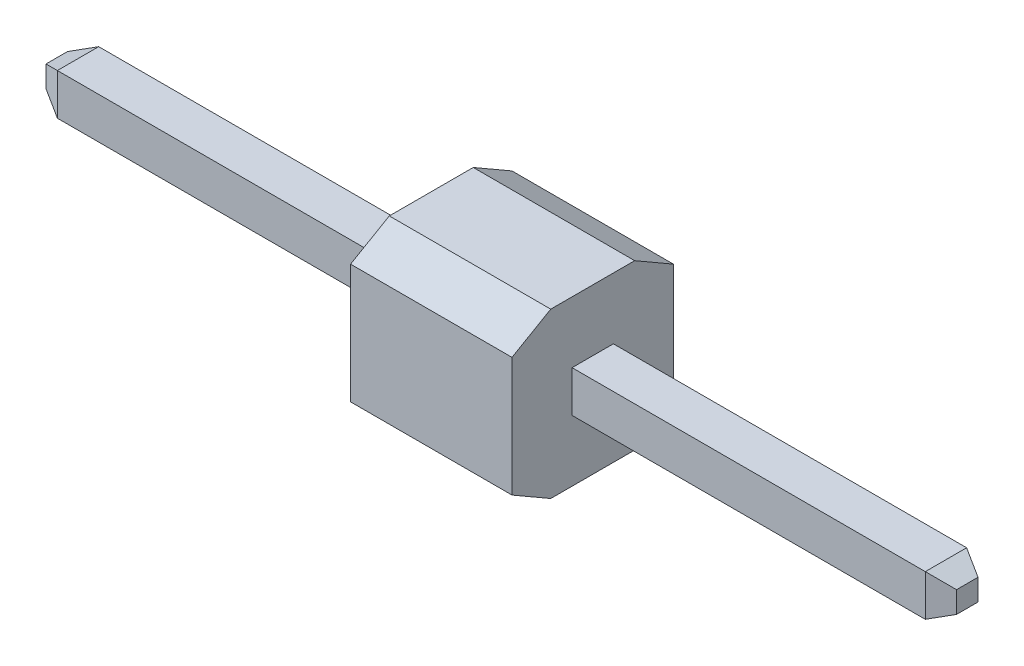
ISO-10303-21;
HEADER;
FILE_DESCRIPTION(('STEP AP214'),'2;1');
FILE_NAME('part.step','',(''),(''),'','','');
FILE_SCHEMA(('AUTOMOTIVE_DESIGN { 1 0 10303 214 1 1 1 1 }'));
ENDSEC;
DATA;
#1=APPLICATION_CONTEXT('core data for automotive mechanical design processes');
#2=APPLICATION_PROTOCOL_DEFINITION('international standard','automotive_design',2000,#1);
#3=PRODUCT_CONTEXT('',#1,'mechanical');
#4=PRODUCT('Part','Part','',(#3));
#5=PRODUCT_RELATED_PRODUCT_CATEGORY('part','',(#4));
#6=PRODUCT_DEFINITION_FORMATION('','',#4);
#7=PRODUCT_DEFINITION_CONTEXT('part definition',#1,'design');
#8=PRODUCT_DEFINITION('design','',#6,#7);
#9=PRODUCT_DEFINITION_SHAPE('','',#8);
#10=(LENGTH_UNIT() NAMED_UNIT(*) SI_UNIT(.MILLI.,.METRE.));
#11=(NAMED_UNIT(*) PLANE_ANGLE_UNIT() SI_UNIT($,.RADIAN.));
#12=(NAMED_UNIT(*) SI_UNIT($,.STERADIAN.) SOLID_ANGLE_UNIT());
#13=UNCERTAINTY_MEASURE_WITH_UNIT(LENGTH_MEASURE(1.E-05),#10,'distance_accuracy_value','');
#14=(GEOMETRIC_REPRESENTATION_CONTEXT(3) GLOBAL_UNCERTAINTY_ASSIGNED_CONTEXT((#13)) GLOBAL_UNIT_ASSIGNED_CONTEXT((#10,
#11,#12)) REPRESENTATION_CONTEXT('',''));
#15=CARTESIAN_POINT('',(0.,0.,0.));
#16=DIRECTION('',(0.,0.,1.));
#17=DIRECTION('',(1.,0.,0.));
#18=AXIS2_PLACEMENT_3D('',#15,#16,#17);
#19=CARTESIAN_POINT('',(5.42107505657293,-2.8571215871937,0.629998634255617));
#20=DIRECTION('',(1.,4.37113882867379E-08,-4.37113882867379E-08));
#21=DIRECTION('',(-4.37113882867379E-08,1.,0.));
#22=AXIS2_PLACEMENT_3D('',#19,#20,#21);
#23=PLANE('',#22);
#24=DIRECTION('',(1.59994777304463E-08,0.500000000000193,0.866025403784327));
#25=VECTOR('',#24,1.);
#26=CARTESIAN_POINT('',(5.42107493358702,-1.6135317487037,-0.940001365744382));
#27=LINE('',#26,#25);
#28=CARTESIAN_POINT('',(5.42107493358702,-1.6135317487037,-0.940001365744382));
#29=VERTEX_POINT('',#28);
#30=CARTESIAN_POINT('',(5.42107494467178,-1.2671215871937,-0.340001365744383));
#31=VERTEX_POINT('',#30);
#32=EDGE_CURVE('E11',#29,#31,#27,.T.);
#33=ORIENTED_EDGE('',*,*,#32,.T.);
#34=DIRECTION('',(4.37113886966664E-08,0.,0.999999999999999));
#35=VECTOR('',#34,1.);
#36=CARTESIAN_POINT('',(5.42107494467178,-1.2671215871937,-0.340001365744383));
#37=LINE('',#36,#35);
#38=CARTESIAN_POINT('',(5.42107500149658,-1.2671215871937,0.959998634255618));
#39=VERTEX_POINT('',#38);
#40=EDGE_CURVE('E304',#31,#39,#37,.T.);
#41=ORIENTED_EDGE('',*,*,#40,.T.);
#42=DIRECTION('',(5.97108668825761E-08,-0.500000000000188,0.866025403784328));
#43=VECTOR('',#42,1.);
#44=CARTESIAN_POINT('',(5.42107500149658,-1.2671215871937,0.959998634255618));
#45=LINE('',#44,#43);
#46=CARTESIAN_POINT('',(5.42107504286549,-1.61353174870369,1.55999863425562));
#47=VERTEX_POINT('',#46);
#48=EDGE_CURVE('E296',#39,#47,#45,.T.);
#49=ORIENTED_EDGE('',*,*,#48,.T.);
#50=DIRECTION('',(4.37113884815545E-08,-0.999999999999999,0.));
#51=VECTOR('',#50,1.);
#52=CARTESIAN_POINT('',(5.42107504286549,-1.61353174870369,1.55999863425562));
#53=LINE('',#52,#51);
#54=CARTESIAN_POINT('',(5.42107512360828,-3.4607114256737,1.55999863425562));
#55=VERTEX_POINT('',#54);
#56=EDGE_CURVE('E281',#47,#55,#53,.T.);
#57=ORIENTED_EDGE('',*,*,#56,.T.);
#58=DIRECTION('',(1.5999479012306E-08,0.500000000000193,0.866025403784327));
#59=VECTOR('',#58,1.);
#60=CARTESIAN_POINT('',(5.42107511252351,-3.8071215871937,0.959998634255618));
#61=LINE('',#60,#59);
#62=CARTESIAN_POINT('',(5.42107511252351,-3.8071215871937,0.959998634255618));
#63=VERTEX_POINT('',#62);
#64=EDGE_CURVE('E265',#63,#55,#61,.T.);
#65=ORIENTED_EDGE('',*,*,#64,.F.);
#66=DIRECTION('',(4.37113886966664E-08,0.,0.999999999999999));
#67=VECTOR('',#66,1.);
#68=CARTESIAN_POINT('',(5.42107505569871,-3.8071215871937,-0.340001365744383));
#69=LINE('',#68,#67);
#70=CARTESIAN_POINT('',(5.42107505569871,-3.8071215871937,-0.340001365744383));
#71=VERTEX_POINT('',#70);
#72=EDGE_CURVE('E248',#71,#63,#69,.T.);
#73=ORIENTED_EDGE('',*,*,#72,.F.);
#74=DIRECTION('',(5.97108656001698E-08,-0.50000000000019,0.866025403784327));
#75=VECTOR('',#74,1.);
#76=CARTESIAN_POINT('',(5.4210750143298,-3.4607114256737,-0.940001365744382));
#77=LINE('',#76,#75);
#78=CARTESIAN_POINT('',(5.4210750143298,-3.4607114256737,-0.940001365744382));
#79=VERTEX_POINT('',#78);
#80=EDGE_CURVE('E242',#79,#71,#77,.T.);
#81=ORIENTED_EDGE('',*,*,#80,.F.);
#82=DIRECTION('',(4.37113884815545E-08,-0.999999999999999,0.));
#83=VECTOR('',#82,1.);
#84=CARTESIAN_POINT('',(5.42107493358702,-1.6135317487037,-0.940001365744382));
#85=LINE('',#84,#83);
#86=EDGE_CURVE('E236',#29,#79,#85,.T.);
#87=ORIENTED_EDGE('',*,*,#86,.F.);
#88=EDGE_LOOP('',(#33,#41,#49,#57,#65,#73,#81,#87));
#89=FACE_BOUND('',#88,.T.);
#90=DIRECTION('',(-4.37113886753159E-08,0.,-0.999999999999999));
#91=VECTOR('',#90,1.);
#92=CARTESIAN_POINT('',(5.42107502859765,-2.2171215871937,0.629998634255617));
#93=LINE('',#92,#91);
#94=CARTESIAN_POINT('',(5.42107502859765,-2.2171215871937,0.629998634255617));
#95=VERTEX_POINT('',#94);
#96=CARTESIAN_POINT('',(5.42107500062236,-2.2171215871937,-0.0100013657443826));
#97=VERTEX_POINT('',#96);
#98=EDGE_CURVE('E302',#95,#97,#93,.T.);
#99=ORIENTED_EDGE('',*,*,#98,.T.);
#100=DIRECTION('',(-4.3711388675316E-08,0.999999999999999,0.));
#101=VECTOR('',#100,1.);
#102=CARTESIAN_POINT('',(5.42107502859765,-2.8571215871937,-0.0100013657443826));
#103=LINE('',#102,#101);
#104=CARTESIAN_POINT('',(5.42107502859765,-2.8571215871937,-0.0100013657443826));
#105=VERTEX_POINT('',#104);
#106=EDGE_CURVE('E293',#105,#97,#103,.T.);
#107=ORIENTED_EDGE('',*,*,#106,.F.);
#108=DIRECTION('',(-4.37113886753159E-08,0.,-0.999999999999999));
#109=VECTOR('',#108,1.);
#110=CARTESIAN_POINT('',(5.42107505657293,-2.8571215871937,0.629998634255617));
#111=LINE('',#110,#109);
#112=CARTESIAN_POINT('',(5.42107505657293,-2.8571215871937,0.629998634255617));
#113=VERTEX_POINT('',#112);
#114=EDGE_CURVE('E278',#113,#105,#111,.T.);
#115=ORIENTED_EDGE('',*,*,#114,.F.);
#116=DIRECTION('',(-4.3711388675316E-08,0.999999999999999,0.));
#117=VECTOR('',#116,1.);
#118=CARTESIAN_POINT('',(5.42107505657293,-2.8571215871937,0.629998634255617));
#119=LINE('',#118,#117);
#120=EDGE_CURVE('E263',#113,#95,#119,.T.);
#121=ORIENTED_EDGE('',*,*,#120,.T.);
#122=EDGE_LOOP('',(#99,#107,#115,#121));
#123=FACE_BOUND('',#122,.T.);
#124=ADVANCED_FACE('F17',(#89,#123),#23,.T.);
#125=CARTESIAN_POINT('',(2.92107505657293,-2.85712169647217,0.629998743534088));
#126=DIRECTION('',(1.,4.37113882867379E-08,-4.37113882867379E-08));
#127=DIRECTION('',(-4.37113882867379E-08,1.,0.));
#128=AXIS2_PLACEMENT_3D('',#125,#126,#127);
#129=PLANE('',#128);
#130=DIRECTION('',(1.59994783714339E-08,0.500000000000193,0.866025403784327));
#131=VECTOR('',#130,1.);
#132=CARTESIAN_POINT('',(2.92107493358702,-1.61353185798217,-0.940001256465912));
#133=LINE('',#132,#131);
#134=CARTESIAN_POINT('',(2.92107493358702,-1.61353185798217,-0.940001256465912));
#135=VERTEX_POINT('',#134);
#136=CARTESIAN_POINT('',(2.92107494467178,-1.26712169647217,-0.340001256465912));
#137=VERTEX_POINT('',#136);
#138=EDGE_CURVE('E24',#135,#137,#133,.T.);
#139=ORIENTED_EDGE('',*,*,#138,.F.);
#140=DIRECTION('',(4.37113882411397E-08,-0.999999999999999,0.));
#141=VECTOR('',#140,1.);
#142=CARTESIAN_POINT('',(2.92107493358702,-1.61353185798217,-0.940001256465912));
#143=LINE('',#142,#141);
#144=CARTESIAN_POINT('',(2.9210750143298,-3.46071153495217,-0.940001256465912));
#145=VERTEX_POINT('',#144);
#146=EDGE_CURVE('E300',#135,#145,#143,.T.);
#147=ORIENTED_EDGE('',*,*,#146,.T.);
#148=DIRECTION('',(5.97108668821449E-08,-0.50000000000019,0.866025403784327));
#149=VECTOR('',#148,1.);
#150=CARTESIAN_POINT('',(2.9210750143298,-3.46071153495217,-0.940001256465912));
#151=LINE('',#150,#149);
#152=CARTESIAN_POINT('',(2.92107505569871,-3.80712169647217,-0.340001256465912));
#153=VERTEX_POINT('',#152);
#154=EDGE_CURVE('E286',#145,#153,#151,.T.);
#155=ORIENTED_EDGE('',*,*,#154,.T.);
#156=DIRECTION('',(4.37113883550593E-08,0.,0.999999999999999));
#157=VECTOR('',#156,1.);
#158=CARTESIAN_POINT('',(2.92107505569871,-3.80712169647217,-0.340001256465912));
#159=LINE('',#158,#157);
#160=CARTESIAN_POINT('',(2.92107511252351,-3.80712169647217,0.959998743534088));
#161=VERTEX_POINT('',#160);
#162=EDGE_CURVE('E271',#153,#161,#159,.T.);
#163=ORIENTED_EDGE('',*,*,#162,.T.);
#164=DIRECTION('',(1.59994783713184E-08,0.500000000000193,0.866025403784327));
#165=VECTOR('',#164,1.);
#166=CARTESIAN_POINT('',(2.92107511252351,-3.80712169647217,0.959998743534088));
#167=LINE('',#166,#165);
#168=CARTESIAN_POINT('',(2.92107512360828,-3.46071153495217,1.55999874353409));
#169=VERTEX_POINT('',#168);
#170=EDGE_CURVE('E253',#161,#169,#167,.T.);
#171=ORIENTED_EDGE('',*,*,#170,.T.);
#172=DIRECTION('',(4.37113882411397E-08,-0.999999999999999,0.));
#173=VECTOR('',#172,1.);
#174=CARTESIAN_POINT('',(2.92107504286549,-1.61353185798217,1.55999874353409));
#175=LINE('',#174,#173);
#176=CARTESIAN_POINT('',(2.92107504286549,-1.61353185798217,1.55999874353409));
#177=VERTEX_POINT('',#176);
#178=EDGE_CURVE('E261',#177,#169,#175,.T.);
#179=ORIENTED_EDGE('',*,*,#178,.F.);
#180=DIRECTION('',(5.97108668825761E-08,-0.500000000000188,0.866025403784328));
#181=VECTOR('',#180,1.);
#182=CARTESIAN_POINT('',(2.92107500149659,-1.26712169647217,0.959998743534088));
#183=LINE('',#182,#181);
#184=CARTESIAN_POINT('',(2.92107500149659,-1.26712169647217,0.959998743534088));
#185=VERTEX_POINT('',#184);
#186=EDGE_CURVE('E276',#185,#177,#183,.T.);
#187=ORIENTED_EDGE('',*,*,#186,.F.);
#188=DIRECTION('',(4.37113883550593E-08,0.,0.999999999999999));
#189=VECTOR('',#188,1.);
#190=CARTESIAN_POINT('',(2.92107494467178,-1.26712169647217,-0.340001256465912));
#191=LINE('',#190,#189);
#192=EDGE_CURVE('E291',#137,#185,#191,.T.);
#193=ORIENTED_EDGE('',*,*,#192,.F.);
#194=EDGE_LOOP('',(#139,#147,#155,#163,#171,#179,#187,#193));
#195=FACE_BOUND('',#194,.T.);
#196=DIRECTION('',(-4.3711388675316E-08,0.999999999999999,0.));
#197=VECTOR('',#196,1.);
#198=CARTESIAN_POINT('',(2.92107502859765,-2.85712169647217,-0.0100012564659119));
#199=LINE('',#198,#197);
#200=CARTESIAN_POINT('',(2.92107502859765,-2.85712169647217,-0.0100012564659119));
#201=VERTEX_POINT('',#200);
#202=CARTESIAN_POINT('',(2.92107500062236,-2.21712169647217,-0.0100012564659119));
#203=VERTEX_POINT('',#202);
#204=EDGE_CURVE('E298',#201,#203,#199,.T.);
#205=ORIENTED_EDGE('',*,*,#204,.T.);
#206=DIRECTION('',(-4.37113886753159E-08,0.,-0.999999999999999));
#207=VECTOR('',#206,1.);
#208=CARTESIAN_POINT('',(2.92107502859765,-2.21712169647217,0.629998743534088));
#209=LINE('',#208,#207);
#210=CARTESIAN_POINT('',(2.92107502859765,-2.21712169647217,0.629998743534088));
#211=VERTEX_POINT('',#210);
#212=EDGE_CURVE('E283',#211,#203,#209,.T.);
#213=ORIENTED_EDGE('',*,*,#212,.F.);
#214=DIRECTION('',(-4.37113879814266E-08,0.999999999999999,0.));
#215=VECTOR('',#214,1.);
#216=CARTESIAN_POINT('',(2.92107505657293,-2.85712169647217,0.629998743534088));
#217=LINE('',#216,#215);
#218=CARTESIAN_POINT('',(2.92107505657293,-2.85712169647217,0.629998743534088));
#219=VERTEX_POINT('',#218);
#220=EDGE_CURVE('E268',#219,#211,#217,.T.);
#221=ORIENTED_EDGE('',*,*,#220,.F.);
#222=DIRECTION('',(-4.37113879814266E-08,0.,-0.999999999999999));
#223=VECTOR('',#222,1.);
#224=CARTESIAN_POINT('',(2.92107505657293,-2.85712169647217,0.629998743534088));
#225=LINE('',#224,#223);
#226=EDGE_CURVE('E251',#219,#201,#225,.T.);
#227=ORIENTED_EDGE('',*,*,#226,.T.);
#228=EDGE_LOOP('',(#205,#213,#221,#227));
#229=FACE_BOUND('',#228,.T.);
#230=ADVANCED_FACE('F314',(#195,#229),#129,.F.);
#231=CARTESIAN_POINT('',(5.42107493358702,-1.6135317487037,-0.940001365744382));
#232=DIRECTION('',(5.97108668343731E-08,-0.866025403784328,0.50000000000019));
#233=DIRECTION('',(-1.59994785476185E-08,-0.500000000000192,-0.866025403784329));
#234=AXIS2_PLACEMENT_3D('',#231,#232,#233);
#235=PLANE('',#234);
#236=ORIENTED_EDGE('',*,*,#138,.T.);
#237=DIRECTION('',(-0.999999999999998,-4.37113875761951E-08,4.37113883755557E-08));
#238=VECTOR('',#237,1.);
#239=CARTESIAN_POINT('',(5.42107494467178,-1.2671215871937,-0.340001365744383));
#240=LINE('',#239,#238);
#241=EDGE_CURVE('E288',#31,#137,#240,.T.);
#242=ORIENTED_EDGE('',*,*,#241,.F.);
#243=ORIENTED_EDGE('',*,*,#32,.F.);
#244=DIRECTION('',(-0.999999999999998,-4.37113882867378E-08,4.37113881091022E-08));
#245=VECTOR('',#244,1.);
#246=CARTESIAN_POINT('',(5.42107493358702,-1.6135317487037,-0.940001365744382));
#247=LINE('',#246,#245);
#248=EDGE_CURVE('E256',#29,#135,#247,.T.);
#249=ORIENTED_EDGE('',*,*,#248,.T.);
#250=EDGE_LOOP('',(#236,#242,#243,#249));
#251=FACE_BOUND('',#250,.T.);
#252=ADVANCED_FACE('F306',(#251),#235,.F.);
#253=CARTESIAN_POINT('',(5.42107494467178,-1.2671215871937,-0.340001365744383));
#254=DIRECTION('',(4.37113882867379E-08,-1.,0.));
#255=DIRECTION('',(1.,4.37113882867379E-08,-4.37113882867379E-08));
#256=AXIS2_PLACEMENT_3D('',#253,#254,#255);
#257=PLANE('',#256);
#258=ORIENTED_EDGE('',*,*,#192,.T.);
#259=DIRECTION('',(-0.999999999999998,-4.37113875761951E-08,4.37113882867378E-08));
#260=VECTOR('',#259,1.);
#261=CARTESIAN_POINT('',(5.42107500149658,-1.2671215871937,0.959998634255618));
#262=LINE('',#261,#260);
#263=EDGE_CURVE('E273',#39,#185,#262,.T.);
#264=ORIENTED_EDGE('',*,*,#263,.F.);
#265=ORIENTED_EDGE('',*,*,#40,.F.);
#266=ORIENTED_EDGE('',*,*,#241,.T.);
#267=EDGE_LOOP('',(#258,#264,#265,#266));
#268=FACE_BOUND('',#267,.T.);
#269=ADVANCED_FACE('F311',(#268),#257,.F.);
#270=CARTESIAN_POINT('',(5.42107500149658,-1.2671215871937,0.959998634255618));
#271=DIRECTION('',(1.59994785476185E-08,-0.86602540378433,-0.50000000000019));
#272=DIRECTION('',(-5.97108668343731E-08,0.500000000000188,-0.866025403784329));
#273=AXIS2_PLACEMENT_3D('',#270,#271,#272);
#274=PLANE('',#273);
#275=ORIENTED_EDGE('',*,*,#186,.T.);
#276=DIRECTION('',(-0.999999999999998,-4.37113882867378E-08,4.37113882867378E-08));
#277=VECTOR('',#276,1.);
#278=CARTESIAN_POINT('',(5.42107504286549,-1.61353174870369,1.55999863425562));
#279=LINE('',#278,#277);
#280=EDGE_CURVE('E258',#47,#177,#279,.T.);
#281=ORIENTED_EDGE('',*,*,#280,.F.);
#282=ORIENTED_EDGE('',*,*,#48,.F.);
#283=ORIENTED_EDGE('',*,*,#263,.T.);
#284=EDGE_LOOP('',(#275,#281,#282,#283));
#285=FACE_BOUND('',#284,.T.);
#286=ADVANCED_FACE('F319',(#285),#274,.F.);
#287=CARTESIAN_POINT('',(5.42107504286549,-1.61353174870369,1.55999863425562));
#288=DIRECTION('',(-4.37113882867379E-08,0.,-1.));
#289=DIRECTION('',(-1.,-4.37113882867379E-08,4.37113882867379E-08));
#290=AXIS2_PLACEMENT_3D('',#287,#288,#289);
#291=PLANE('',#290);
#292=ORIENTED_EDGE('',*,*,#178,.T.);
#293=DIRECTION('',(-0.999999999999998,-4.37113882867378E-08,4.37113882867378E-08));
#294=VECTOR('',#293,1.);
#295=CARTESIAN_POINT('',(5.42107512360828,-3.4607114256737,1.55999863425562));
#296=LINE('',#295,#294);
#297=EDGE_CURVE('E245',#55,#169,#296,.T.);
#298=ORIENTED_EDGE('',*,*,#297,.F.);
#299=ORIENTED_EDGE('',*,*,#56,.F.);
#300=ORIENTED_EDGE('',*,*,#280,.T.);
#301=EDGE_LOOP('',(#292,#298,#299,#300));
#302=FACE_BOUND('',#301,.T.);
#303=ADVANCED_FACE('F326',(#302),#291,.F.);
#304=CARTESIAN_POINT('',(5.42107511252351,-3.8071215871937,0.959998634255618));
#305=DIRECTION('',(5.97108668343731E-08,-0.866025403784328,0.50000000000019));
#306=DIRECTION('',(-1.59994785476185E-08,-0.500000000000192,-0.866025403784329));
#307=AXIS2_PLACEMENT_3D('',#304,#305,#306);
#308=PLANE('',#307);
#309=ORIENTED_EDGE('',*,*,#170,.F.);
#310=DIRECTION('',(-0.999999999999998,-4.37113868656524E-08,4.37113882867378E-08));
#311=VECTOR('',#310,1.);
#312=CARTESIAN_POINT('',(5.42107511252351,-3.8071215871937,0.959998634255618));
#313=LINE('',#312,#311);
#314=EDGE_CURVE('E239',#63,#161,#313,.T.);
#315=ORIENTED_EDGE('',*,*,#314,.F.);
#316=ORIENTED_EDGE('',*,*,#64,.T.);
#317=ORIENTED_EDGE('',*,*,#297,.T.);
#318=EDGE_LOOP('',(#309,#315,#316,#317));
#319=FACE_BOUND('',#318,.T.);
#320=ADVANCED_FACE('F329',(#319),#308,.T.);
#321=CARTESIAN_POINT('',(5.42107505569871,-3.8071215871937,-0.340001365744383));
#322=DIRECTION('',(4.37113882867379E-08,-1.,0.));
#323=DIRECTION('',(1.,4.37113882867379E-08,-4.37113882867379E-08));
#324=AXIS2_PLACEMENT_3D('',#321,#322,#323);
#325=PLANE('',#324);
#326=ORIENTED_EDGE('',*,*,#162,.F.);
#327=DIRECTION('',(-0.999999999999998,-4.37113868656524E-08,4.37113883755557E-08));
#328=VECTOR('',#327,1.);
#329=CARTESIAN_POINT('',(5.42107505569871,-3.8071215871937,-0.340001365744383));
#330=LINE('',#329,#328);
#331=EDGE_CURVE('E233',#71,#153,#330,.T.);
#332=ORIENTED_EDGE('',*,*,#331,.F.);
#333=ORIENTED_EDGE('',*,*,#72,.T.);
#334=ORIENTED_EDGE('',*,*,#314,.T.);
#335=EDGE_LOOP('',(#326,#332,#333,#334));
#336=FACE_BOUND('',#335,.T.);
#337=ADVANCED_FACE('F333',(#336),#325,.T.);
#338=CARTESIAN_POINT('',(5.4210750143298,-3.4607114256737,-0.940001365744382));
#339=DIRECTION('',(1.59994785476185E-08,-0.86602540378433,-0.50000000000019));
#340=DIRECTION('',(-5.97108668343731E-08,0.500000000000188,-0.866025403784329));
#341=AXIS2_PLACEMENT_3D('',#338,#339,#340);
#342=PLANE('',#341);
#343=ORIENTED_EDGE('',*,*,#154,.F.);
#344=DIRECTION('',(-0.999999999999998,-4.37113882867378E-08,4.37113881091021E-08));
#345=VECTOR('',#344,1.);
#346=CARTESIAN_POINT('',(5.4210750143298,-3.4607114256737,-0.940001365744382));
#347=LINE('',#346,#345);
#348=EDGE_CURVE('E230',#79,#145,#347,.T.);
#349=ORIENTED_EDGE('',*,*,#348,.F.);
#350=ORIENTED_EDGE('',*,*,#80,.T.);
#351=ORIENTED_EDGE('',*,*,#331,.T.);
#352=EDGE_LOOP('',(#343,#349,#350,#351));
#353=FACE_BOUND('',#352,.T.);
#354=ADVANCED_FACE('F337',(#353),#342,.T.);
#355=CARTESIAN_POINT('',(5.42107493358702,-1.6135317487037,-0.940001365744382));
#356=DIRECTION('',(-4.37113882867379E-08,0.,-1.));
#357=DIRECTION('',(-4.37113882867379E-08,1.,0.));
#358=AXIS2_PLACEMENT_3D('',#355,#356,#357);
#359=PLANE('',#358);
#360=ORIENTED_EDGE('',*,*,#146,.F.);
#361=ORIENTED_EDGE('',*,*,#248,.F.);
#362=ORIENTED_EDGE('',*,*,#86,.T.);
#363=ORIENTED_EDGE('',*,*,#348,.T.);
#364=EDGE_LOOP('',(#360,#361,#362,#363));
#365=FACE_BOUND('',#364,.T.);
#366=ADVANCED_FACE('F339',(#365),#359,.T.);
#367=CARTESIAN_POINT('',(-2.87892494342706,-2.85712194999822,0.62999899706014));
#368=DIRECTION('',(-1.,-4.37113882867379E-08,4.37113882867379E-08));
#369=DIRECTION('',(4.37113882867379E-08,-1.,0.));
#370=AXIS2_PLACEMENT_3D('',#367,#368,#369);
#371=PLANE('',#370);
#372=DIRECTION('',(4.3711387402424E-08,-0.999999999999999,0.));
#373=VECTOR('',#372,1.);
#374=CARTESIAN_POINT('',(-2.87892498592489,-2.37100347718822,0.14388052425114));
#375=LINE('',#374,#373);
#376=CARTESIAN_POINT('',(-2.87892498592489,-2.37100347718822,0.14388052425114));
#377=VERTEX_POINT('',#376);
#378=CARTESIAN_POINT('',(-2.87892497140235,-2.70324042279822,0.14388052425114));
#379=VERTEX_POINT('',#378);
#380=EDGE_CURVE('E228',#377,#379,#375,.T.);
#381=ORIENTED_EDGE('',*,*,#380,.T.);
#382=DIRECTION('',(4.37113874013716E-08,0.,0.999999999999999));
#383=VECTOR('',#382,1.);
#384=CARTESIAN_POINT('',(-2.87892497140235,-2.70324042279822,0.14388052425114));
#385=LINE('',#384,#383);
#386=CARTESIAN_POINT('',(-2.87892495687982,-2.70324042279822,0.47611746986914));
#387=VERTEX_POINT('',#386);
#388=EDGE_CURVE('E223',#379,#387,#385,.T.);
#389=ORIENTED_EDGE('',*,*,#388,.T.);
#390=DIRECTION('',(-4.37113900757526E-08,0.999999999999999,0.));
#391=VECTOR('',#390,1.);
#392=CARTESIAN_POINT('',(-2.87892495687982,-2.70324042279822,0.47611746986914));
#393=LINE('',#392,#391);
#394=CARTESIAN_POINT('',(-2.87892497140235,-2.37100347718822,0.47611746986914));
#395=VERTEX_POINT('',#394);
#396=EDGE_CURVE('E215',#387,#395,#393,.T.);
#397=ORIENTED_EDGE('',*,*,#396,.T.);
#398=DIRECTION('',(-4.37113847280434E-08,0.,-0.999999999999999));
#399=VECTOR('',#398,1.);
#400=CARTESIAN_POINT('',(-2.87892497140235,-2.37100347718822,0.47611746986914));
#401=LINE('',#400,#399);
#402=EDGE_CURVE('E207',#395,#377,#401,.T.);
#403=ORIENTED_EDGE('',*,*,#402,.T.);
#404=EDGE_LOOP('',(#381,#389,#397,#403));
#405=FACE_BOUND('',#404,.T.);
#406=ADVANCED_FACE('F341',(#405),#371,.T.);
#407=CARTESIAN_POINT('',(-2.87892494342706,-2.85712194999822,0.62999899706014));
#408=DIRECTION('',(4.37113882867379E-08,-1.,0.));
#409=DIRECTION('',(-4.37113882867379E-08,0.,-1.));
#410=AXIS2_PLACEMENT_3D('',#407,#408,#409);
#411=PLANE('',#410);
#412=DIRECTION('',(0.999999999999998,4.37113891700451E-08,-4.37113882769955E-08));
#413=VECTOR('',#412,1.);
#414=CARTESIAN_POINT('',(-2.54892494342706,-2.85712193557346,0.629998982635382));
#415=LINE('',#414,#413);
#416=CARTESIAN_POINT('',(-2.54892494342706,-2.85712193557346,0.629998982635382));
#417=VERTEX_POINT('',#416);
#418=EDGE_CURVE('E225',#417,#219,#415,.T.);
#419=ORIENTED_EDGE('',*,*,#418,.F.);
#420=DIRECTION('',(-4.37113886753159E-08,0.,-0.999999999999999));
#421=VECTOR('',#420,1.);
#422=CARTESIAN_POINT('',(-2.54892494342706,-2.85712193557346,0.629998982635382));
#423=LINE('',#422,#421);
#424=CARTESIAN_POINT('',(-2.54892497140235,-2.85712193557346,-0.010001017364618));
#425=VERTEX_POINT('',#424);
#426=EDGE_CURVE('E217',#417,#425,#423,.T.);
#427=ORIENTED_EDGE('',*,*,#426,.T.);
#428=DIRECTION('',(0.999999999999998,4.37113891700451E-08,-4.37113882161057E-08));
#429=VECTOR('',#428,1.);
#430=CARTESIAN_POINT('',(-2.54892497140235,-2.85712193557346,-0.010001017364618));
#431=LINE('',#430,#429);
#432=EDGE_CURVE('E220',#425,#201,#431,.T.);
#433=ORIENTED_EDGE('',*,*,#432,.T.);
#434=ORIENTED_EDGE('',*,*,#226,.F.);
#435=EDGE_LOOP('',(#419,#427,#433,#434));
#436=FACE_BOUND('',#435,.T.);
#437=ADVANCED_FACE('F348',(#436),#411,.T.);
#438=CARTESIAN_POINT('',(-2.87892497140235,-2.85712194999822,-0.0100010029398598));
#439=DIRECTION('',(-4.37113882867379E-08,0.,-1.));
#440=DIRECTION('',(-1.,-4.37113882867379E-08,4.37113882867379E-08));
#441=AXIS2_PLACEMENT_3D('',#438,#439,#440);
#442=PLANE('',#441);
#443=ORIENTED_EDGE('',*,*,#432,.F.);
#444=DIRECTION('',(-4.3711388675316E-08,0.999999999999999,0.));
#445=VECTOR('',#444,1.);
#446=CARTESIAN_POINT('',(-2.54892497140235,-2.85712193557346,-0.010001017364618));
#447=LINE('',#446,#445);
#448=CARTESIAN_POINT('',(-2.54892499937764,-2.21712193557346,-0.010001017364618));
#449=VERTEX_POINT('',#448);
#450=EDGE_CURVE('E209',#425,#449,#447,.T.);
#451=ORIENTED_EDGE('',*,*,#450,.T.);
#452=DIRECTION('',(0.999999999999998,4.37113888452998E-08,-4.37113882161057E-08));
#453=VECTOR('',#452,1.);
#454=CARTESIAN_POINT('',(-2.54892499937764,-2.21712193557346,-0.010001017364618));
#455=LINE('',#454,#453);
#456=EDGE_CURVE('E212',#449,#203,#455,.T.);
#457=ORIENTED_EDGE('',*,*,#456,.T.);
#458=ORIENTED_EDGE('',*,*,#204,.F.);
#459=EDGE_LOOP('',(#443,#451,#457,#458));
#460=FACE_BOUND('',#459,.T.);
#461=ADVANCED_FACE('F424',(#460),#442,.T.);
#462=CARTESIAN_POINT('',(-2.87892497140235,-2.21712194999822,0.62999899706014));
#463=DIRECTION('',(4.37113882867379E-08,-1.,0.));
#464=DIRECTION('',(-4.37113882867379E-08,0.,-1.));
#465=AXIS2_PLACEMENT_3D('',#462,#463,#464);
#466=PLANE('',#465);
#467=ORIENTED_EDGE('',*,*,#456,.F.);
#468=DIRECTION('',(4.37113900630947E-08,0.,0.999999999999999));
#469=VECTOR('',#468,1.);
#470=CARTESIAN_POINT('',(-2.54892499937764,-2.21712193557347,-0.010001017364618));
#471=LINE('',#470,#469);
#472=CARTESIAN_POINT('',(-2.54892497140235,-2.21712193557346,0.629998982635382));
#473=VERTEX_POINT('',#472);
#474=EDGE_CURVE('E201',#449,#473,#471,.T.);
#475=ORIENTED_EDGE('',*,*,#474,.T.);
#476=DIRECTION('',(0.999999999999998,4.37113888452998E-08,-4.37113882769955E-08));
#477=VECTOR('',#476,1.);
#478=CARTESIAN_POINT('',(-2.54892497140235,-2.21712193557346,0.629998982635382));
#479=LINE('',#478,#477);
#480=EDGE_CURVE('E204',#473,#211,#479,.T.);
#481=ORIENTED_EDGE('',*,*,#480,.T.);
#482=ORIENTED_EDGE('',*,*,#212,.T.);
#483=EDGE_LOOP('',(#467,#475,#481,#482));
#484=FACE_BOUND('',#483,.T.);
#485=ADVANCED_FACE('F421',(#484),#466,.F.);
#486=CARTESIAN_POINT('',(-2.87892494342706,-2.85712194999822,0.62999899706014));
#487=DIRECTION('',(-4.37113882867379E-08,0.,-1.));
#488=DIRECTION('',(-1.,-4.37113882867379E-08,4.37113882867379E-08));
#489=AXIS2_PLACEMENT_3D('',#486,#487,#488);
#490=PLANE('',#489);
#491=ORIENTED_EDGE('',*,*,#480,.F.);
#492=DIRECTION('',(4.37113900630948E-08,-0.999999999999999,0.));
#493=VECTOR('',#492,1.);
#494=CARTESIAN_POINT('',(-2.54892497140235,-2.21712193557346,0.629998982635382));
#495=LINE('',#494,#493);
#496=EDGE_CURVE('E196',#473,#417,#495,.T.);
#497=ORIENTED_EDGE('',*,*,#496,.T.);
#498=ORIENTED_EDGE('',*,*,#418,.T.);
#499=ORIENTED_EDGE('',*,*,#220,.T.);
#500=EDGE_LOOP('',(#491,#497,#498,#499));
#501=FACE_BOUND('',#500,.T.);
#502=ADVANCED_FACE('F376',(#501),#490,.F.);
#503=CARTESIAN_POINT('',(-2.87892494342706,-2.85712194999822,0.62999899706014));
#504=DIRECTION('',(-4.37113882867379E-08,0.,-1.));
#505=DIRECTION('',(-1.,-4.37113882867379E-08,4.37113882867379E-08));
#506=AXIS2_PLACEMENT_3D('',#503,#504,#505);
#507=PLANE('',#506);
#508=DIRECTION('',(0.999999999999998,4.37113933917341E-08,-4.37113882769955E-08));
#509=VECTOR('',#508,1.);
#510=CARTESIAN_POINT('',(5.42107505657293,-2.85712158719371,0.629998634255617));
#511=LINE('',#510,#509);
#512=CARTESIAN_POINT('',(10.8910750565729,-2.8571213480924,0.629998395154324));
#513=VERTEX_POINT('',#512);
#514=EDGE_CURVE('E199',#113,#513,#511,.T.);
#515=ORIENTED_EDGE('',*,*,#514,.T.);
#516=DIRECTION('',(-4.37113900630948E-08,0.999999999999999,0.));
#517=VECTOR('',#516,1.);
#518=CARTESIAN_POINT('',(10.8910750565729,-2.8571213480924,0.629998395154324));
#519=LINE('',#518,#517);
#520=CARTESIAN_POINT('',(10.8910750285976,-2.2171213480924,0.629998395154324));
#521=VERTEX_POINT('',#520);
#522=EDGE_CURVE('E191',#513,#521,#519,.T.);
#523=ORIENTED_EDGE('',*,*,#522,.T.);
#524=DIRECTION('',(0.999999999999998,4.37113829998842E-08,-4.37113882769955E-08));
#525=VECTOR('',#524,1.);
#526=CARTESIAN_POINT('',(5.42107502859765,-2.21712158719369,0.629998634255617));
#527=LINE('',#526,#525);
#528=EDGE_CURVE('E194',#95,#521,#527,.T.);
#529=ORIENTED_EDGE('',*,*,#528,.F.);
#530=ORIENTED_EDGE('',*,*,#120,.F.);
#531=EDGE_LOOP('',(#515,#523,#529,#530));
#532=FACE_BOUND('',#531,.T.);
#533=ADVANCED_FACE('F367',(#532),#507,.F.);
#534=CARTESIAN_POINT('',(-2.87892497140235,-2.21712194999822,0.62999899706014));
#535=DIRECTION('',(4.37113882867379E-08,-1.,0.));
#536=DIRECTION('',(-4.37113882867379E-08,0.,-1.));
#537=AXIS2_PLACEMENT_3D('',#534,#535,#536);
#538=PLANE('',#537);
#539=ORIENTED_EDGE('',*,*,#528,.T.);
#540=DIRECTION('',(-4.37113900630947E-08,0.,-0.999999999999999));
#541=VECTOR('',#540,1.);
#542=CARTESIAN_POINT('',(10.8910750285976,-2.2171213480924,0.629998395154324));
#543=LINE('',#542,#541);
#544=CARTESIAN_POINT('',(10.8910750006224,-2.21712134809241,-0.0100016048456765));
#545=VERTEX_POINT('',#544);
#546=EDGE_CURVE('E186',#521,#545,#543,.T.);
#547=ORIENTED_EDGE('',*,*,#546,.T.);
#548=DIRECTION('',(0.999999999999998,4.37113829998842E-08,-4.37113881146228E-08));
#549=VECTOR('',#548,1.);
#550=CARTESIAN_POINT('',(5.42107500062236,-2.21712158719369,-0.0100013657443823));
#551=LINE('',#550,#549);
#552=EDGE_CURVE('E189',#97,#545,#551,.T.);
#553=ORIENTED_EDGE('',*,*,#552,.F.);
#554=ORIENTED_EDGE('',*,*,#98,.F.);
#555=EDGE_LOOP('',(#539,#547,#553,#554));
#556=FACE_BOUND('',#555,.T.);
#557=ADVANCED_FACE('F364',(#556),#538,.F.);
#558=CARTESIAN_POINT('',(-2.87892497140235,-2.85712194999822,-0.0100010029398598));
#559=DIRECTION('',(-4.37113882867379E-08,0.,-1.));
#560=DIRECTION('',(-1.,-4.37113882867379E-08,4.37113882867379E-08));
#561=AXIS2_PLACEMENT_3D('',#558,#559,#560);
#562=PLANE('',#561);
#563=ORIENTED_EDGE('',*,*,#552,.T.);
#564=DIRECTION('',(4.37113872875372E-08,-0.999999999999999,0.));
#565=VECTOR('',#564,1.);
#566=CARTESIAN_POINT('',(10.8910750006224,-2.21712134809241,-0.0100016048456764));
#567=LINE('',#566,#565);
#568=CARTESIAN_POINT('',(10.8910750285976,-2.85712134809241,-0.0100016048456765));
#569=VERTEX_POINT('',#568);
#570=EDGE_CURVE('E176',#545,#569,#567,.T.);
#571=ORIENTED_EDGE('',*,*,#570,.T.);
#572=DIRECTION('',(0.999999999999998,4.37113933917341E-08,-4.37113881146228E-08));
#573=VECTOR('',#572,1.);
#574=CARTESIAN_POINT('',(5.42107502859765,-2.85712158719371,-0.0100013657443823));
#575=LINE('',#574,#573);
#576=EDGE_CURVE('E179',#105,#569,#575,.T.);
#577=ORIENTED_EDGE('',*,*,#576,.F.);
#578=ORIENTED_EDGE('',*,*,#106,.T.);
#579=EDGE_LOOP('',(#563,#571,#577,#578));
#580=FACE_BOUND('',#579,.T.);
#581=ADVANCED_FACE('F366',(#580),#562,.T.);
#582=CARTESIAN_POINT('',(-2.87892494342706,-2.85712194999822,0.62999899706014));
#583=DIRECTION('',(4.37113882867379E-08,-1.,0.));
#584=DIRECTION('',(-4.37113882867379E-08,0.,-1.));
#585=AXIS2_PLACEMENT_3D('',#582,#583,#584);
#586=PLANE('',#585);
#587=ORIENTED_EDGE('',*,*,#576,.T.);
#588=DIRECTION('',(4.37113845119796E-08,0.,0.999999999999999));
#589=VECTOR('',#588,1.);
#590=CARTESIAN_POINT('',(10.8910750285976,-2.85712134809241,-0.0100016048456765));
#591=LINE('',#590,#589);
#592=EDGE_CURVE('E167',#569,#513,#591,.T.);
#593=ORIENTED_EDGE('',*,*,#592,.T.);
#594=ORIENTED_EDGE('',*,*,#514,.F.);
#595=ORIENTED_EDGE('',*,*,#114,.T.);
#596=EDGE_LOOP('',(#587,#593,#594,#595));
#597=FACE_BOUND('',#596,.T.);
#598=ADVANCED_FACE('F373',(#597),#586,.T.);
#599=CARTESIAN_POINT('',(11.2210750565729,-2.85712133366765,0.629998380729565));
#600=DIRECTION('',(-1.,-4.37113882867379E-08,4.37113882867379E-08));
#601=DIRECTION('',(4.37113882867379E-08,-1.,0.));
#602=AXIS2_PLACEMENT_3D('',#599,#600,#601);
#603=PLANE('',#602);
#604=DIRECTION('',(-4.37113874024243E-08,0.999999999999999,0.));
#605=VECTOR('',#604,1.);
#606=CARTESIAN_POINT('',(11.2210750285976,-2.70323980646765,0.143879907920565));
#607=LINE('',#606,#605);
#608=CARTESIAN_POINT('',(11.2210750285976,-2.70323980646765,0.143879907920565));
#609=VERTEX_POINT('',#608);
#610=CARTESIAN_POINT('',(11.2210750140751,-2.37100286085765,0.143879907920565));
#611=VERTEX_POINT('',#610);
#612=EDGE_CURVE('E153',#609,#611,#607,.T.);
#613=ORIENTED_EDGE('',*,*,#612,.T.);
#614=DIRECTION('',(4.37113874013716E-08,0.,0.999999999999999));
#615=VECTOR('',#614,1.);
#616=CARTESIAN_POINT('',(11.2210750140751,-2.37100286085765,0.143879907920565));
#617=LINE('',#616,#615);
#618=CARTESIAN_POINT('',(11.2210750285976,-2.37100286085765,0.476116853538565));
#619=VERTEX_POINT('',#618);
#620=EDGE_CURVE('E395',#611,#619,#617,.T.);
#621=ORIENTED_EDGE('',*,*,#620,.T.);
#622=DIRECTION('',(4.37113927490806E-08,-0.999999999999999,0.));
#623=VECTOR('',#622,1.);
#624=CARTESIAN_POINT('',(11.2210750285976,-2.37100286085765,0.476116853538565));
#625=LINE('',#624,#623);
#626=CARTESIAN_POINT('',(11.2210750431202,-2.70323980646765,0.476116853538565));
#627=VERTEX_POINT('',#626);
#628=EDGE_CURVE('E156',#619,#627,#625,.T.);
#629=ORIENTED_EDGE('',*,*,#628,.T.);
#630=DIRECTION('',(-4.37113980946847E-08,0.,-0.999999999999999));
#631=VECTOR('',#630,1.);
#632=CARTESIAN_POINT('',(11.2210750431202,-2.70323980646764,0.476116853538565));
#633=LINE('',#632,#631);
#634=EDGE_CURVE('E149',#627,#609,#633,.T.);
#635=ORIENTED_EDGE('',*,*,#634,.T.);
#636=EDGE_LOOP('',(#613,#621,#629,#635));
#637=FACE_BOUND('',#636,.T.);
#638=ADVANCED_FACE('F151',(#637),#603,.F.);
#639=CARTESIAN_POINT('',(-2.87892496467598,-2.37100347718822,0.62999899706014));
#640=DIRECTION('',(-0.422618301356784,0.906307768563367,1.84732310895534E-08));
#641=DIRECTION('',(4.37113882867379E-08,0.,1.));
#642=AXIS2_PLACEMENT_3D('',#639,#640,#641);
#643=PLANE('',#642);
#644=DIRECTION('',(0.834817095446927,0.389281657126017,-0.389281657126018));
#645=VECTOR('',#644,1.);
#646=CARTESIAN_POINT('',(-2.87892498592491,-2.3710034771877,0.143880524251623));
#647=LINE('',#646,#645);
#648=EDGE_CURVE('E181',#377,#449,#647,.T.);
#649=ORIENTED_EDGE('',*,*,#648,.F.);
#650=ORIENTED_EDGE('',*,*,#402,.F.);
#651=DIRECTION('',(-0.834817129479006,-0.389281657126019,-0.389281584143989));
#652=VECTOR('',#651,1.);
#653=CARTESIAN_POINT('',(-2.54892497140279,-2.217121935572,0.629998982634844));
#654=LINE('',#653,#652);
#655=EDGE_CURVE('E404',#473,#395,#654,.T.);
#656=ORIENTED_EDGE('',*,*,#655,.F.);
#657=ORIENTED_EDGE('',*,*,#474,.F.);
#658=EDGE_LOOP('',(#649,#650,#656,#657));
#659=FACE_BOUND('',#658,.T.);
#660=ADVANCED_FACE('F418',(#659),#643,.T.);
#661=CARTESIAN_POINT('',(-2.87892495015344,-2.85712194999822,0.47611746986914));
#662=DIRECTION('',(-0.422618222124841,-1.84732292043498E-08,0.906307805509828));
#663=DIRECTION('',(4.37113882867379E-08,-1.,0.));
#664=AXIS2_PLACEMENT_3D('',#661,#662,#663);
#665=PLANE('',#664);
#666=ORIENTED_EDGE('',*,*,#655,.T.);
#667=ORIENTED_EDGE('',*,*,#396,.F.);
#668=DIRECTION('',(-0.834817163511088,0.389281584143984,-0.389281584143987));
#669=VECTOR('',#668,1.);
#670=CARTESIAN_POINT('',(-2.54892494342592,-2.85712193557073,0.629998982635654));
#671=LINE('',#670,#669);
#672=EDGE_CURVE('E160',#417,#387,#671,.T.);
#673=ORIENTED_EDGE('',*,*,#672,.F.);
#674=ORIENTED_EDGE('',*,*,#496,.F.);
#675=EDGE_LOOP('',(#666,#667,#673,#674));
#676=FACE_BOUND('',#675,.T.);
#677=ADVANCED_FACE('F434',(#676),#665,.T.);
#678=CARTESIAN_POINT('',(-2.54892497140235,-2.85712193557346,-0.010001017364618));
#679=DIRECTION('',(0.422618301356784,1.8473232667688E-08,0.906307768563367));
#680=DIRECTION('',(-4.37113882867379E-08,1.,0.));
#681=AXIS2_PLACEMENT_3D('',#678,#679,#680);
#682=PLANE('',#681);
#683=ORIENTED_EDGE('',*,*,#648,.T.);
#684=ORIENTED_EDGE('',*,*,#450,.F.);
#685=DIRECTION('',(0.834817129479008,-0.389281584143985,-0.389281657126018));
#686=VECTOR('',#685,1.);
#687=CARTESIAN_POINT('',(-2.87892497140519,-2.70324042280576,0.1438805242526));
#688=LINE('',#687,#686);
#689=EDGE_CURVE('E170',#379,#425,#688,.T.);
#690=ORIENTED_EDGE('',*,*,#689,.F.);
#691=ORIENTED_EDGE('',*,*,#380,.F.);
#692=EDGE_LOOP('',(#683,#684,#690,#691));
#693=FACE_BOUND('',#692,.T.);
#694=ADVANCED_FACE('F413',(#693),#682,.F.);
#695=CARTESIAN_POINT('',(-2.54892494342706,-2.85712193557346,0.629998982635382));
#696=DIRECTION('',(0.422618222124841,0.906307805509828,-1.84732308250282E-08));
#697=DIRECTION('',(-4.37113882867379E-08,0.,-1.));
#698=AXIS2_PLACEMENT_3D('',#695,#696,#697);
#699=PLANE('',#698);
#700=ORIENTED_EDGE('',*,*,#672,.T.);
#701=ORIENTED_EDGE('',*,*,#388,.F.);
#702=ORIENTED_EDGE('',*,*,#689,.T.);
#703=ORIENTED_EDGE('',*,*,#426,.F.);
#704=EDGE_LOOP('',(#700,#701,#702,#703));
#705=FACE_BOUND('',#704,.T.);
#706=ADVANCED_FACE('F429',(#705),#699,.F.);
#707=CARTESIAN_POINT('',(11.2210750498466,-2.70323980646765,0.629998380729565));
#708=DIRECTION('',(0.422618301356784,-0.906307768563367,-1.84732310470096E-08));
#709=DIRECTION('',(4.37113882867379E-08,0.,1.));
#710=AXIS2_PLACEMENT_3D('',#707,#708,#709);
#711=PLANE('',#710);
#712=DIRECTION('',(-0.834817129479007,-0.389281657126017,-0.389281584143988));
#713=VECTOR('',#712,1.);
#714=CARTESIAN_POINT('',(11.2210750285977,-2.70323980646817,0.143879907921048));
#715=LINE('',#714,#713);
#716=EDGE_CURVE('E164',#609,#569,#715,.T.);
#717=ORIENTED_EDGE('',*,*,#716,.F.);
#718=ORIENTED_EDGE('',*,*,#634,.F.);
#719=DIRECTION('',(0.834817095446928,0.389281657126015,-0.389281657126018));
#720=VECTOR('',#719,1.);
#721=CARTESIAN_POINT('',(10.8910750565729,-2.8571213480924,0.629998395154324));
#722=LINE('',#721,#720);
#723=EDGE_CURVE('E392',#513,#627,#722,.T.);
#724=ORIENTED_EDGE('',*,*,#723,.F.);
#725=ORIENTED_EDGE('',*,*,#592,.F.);
#726=EDGE_LOOP('',(#717,#718,#724,#725));
#727=FACE_BOUND('',#726,.T.);
#728=ADVANCED_FACE('F165',(#727),#711,.T.);
#729=CARTESIAN_POINT('',(10.8910750565729,-2.8571213480924,0.629998395154324));
#730=DIRECTION('',(-0.422618301356784,-1.8473232667688E-08,-0.906307768563367));
#731=DIRECTION('',(-4.37113882867379E-08,1.,0.));
#732=AXIS2_PLACEMENT_3D('',#729,#730,#731);
#733=PLANE('',#732);
#734=ORIENTED_EDGE('',*,*,#723,.T.);
#735=ORIENTED_EDGE('',*,*,#628,.F.);
#736=DIRECTION('',(0.834817129479004,-0.389281584143993,-0.389281657126018));
#737=VECTOR('',#736,1.);
#738=CARTESIAN_POINT('',(10.8910750285992,-2.2171213480882,0.629998395153421));
#739=LINE('',#738,#737);
#740=EDGE_CURVE('E389',#521,#619,#739,.T.);
#741=ORIENTED_EDGE('',*,*,#740,.F.);
#742=ORIENTED_EDGE('',*,*,#522,.F.);
#743=EDGE_LOOP('',(#734,#735,#741,#742));
#744=FACE_BOUND('',#743,.T.);
#745=ADVANCED_FACE('F390',(#744),#733,.F.);
#746=CARTESIAN_POINT('',(11.221075035324,-2.85712133366765,0.143879907920565));
#747=DIRECTION('',(0.422618222124841,1.84732292043498E-08,-0.906307805509828));
#748=DIRECTION('',(4.37113882867379E-08,-1.,0.));
#749=AXIS2_PLACEMENT_3D('',#746,#747,#748);
#750=PLANE('',#749);
#751=ORIENTED_EDGE('',*,*,#716,.T.);
#752=ORIENTED_EDGE('',*,*,#570,.F.);
#753=DIRECTION('',(-0.834817163511087,0.389281584143985,-0.389281584143988));
#754=VECTOR('',#753,1.);
#755=CARTESIAN_POINT('',(11.2210750140751,-2.37100286085713,0.143879907921048));
#756=LINE('',#755,#754);
#757=EDGE_CURVE('E175',#611,#545,#756,.T.);
#758=ORIENTED_EDGE('',*,*,#757,.F.);
#759=ORIENTED_EDGE('',*,*,#612,.F.);
#760=EDGE_LOOP('',(#751,#752,#758,#759));
#761=FACE_BOUND('',#760,.T.);
#762=ADVANCED_FACE('F173',(#761),#750,.T.);
#763=CARTESIAN_POINT('',(10.8910750285976,-2.2171213480924,0.629998395154324));
#764=DIRECTION('',(-0.422618222124841,-0.906307805509828,1.84732307824844E-08));
#765=DIRECTION('',(-4.37113882867379E-08,0.,-1.));
#766=AXIS2_PLACEMENT_3D('',#763,#764,#765);
#767=PLANE('',#766);
#768=ORIENTED_EDGE('',*,*,#740,.T.);
#769=ORIENTED_EDGE('',*,*,#620,.F.);
#770=ORIENTED_EDGE('',*,*,#757,.T.);
#771=ORIENTED_EDGE('',*,*,#546,.F.);
#772=EDGE_LOOP('',(#768,#769,#770,#771));
#773=FACE_BOUND('',#772,.T.);
#774=ADVANCED_FACE('F394',(#773),#767,.F.);
#775=CLOSED_SHELL('',(#124,#230,#252,#269,#286,#303,#320,#337,#354,#366,#406,#437,#461,#485,
#502,#533,#557,#581,#598,#638,#660,#677,#694,#706,#728,#745,#762,#774));
#776=MANIFOLD_SOLID_BREP('B1',#775);
#777=ADVANCED_BREP_SHAPE_REPRESENTATION('',(#18,#776),#14);
#778=SHAPE_DEFINITION_REPRESENTATION(#9,#777);
ENDSEC;
END-ISO-10303-21;
